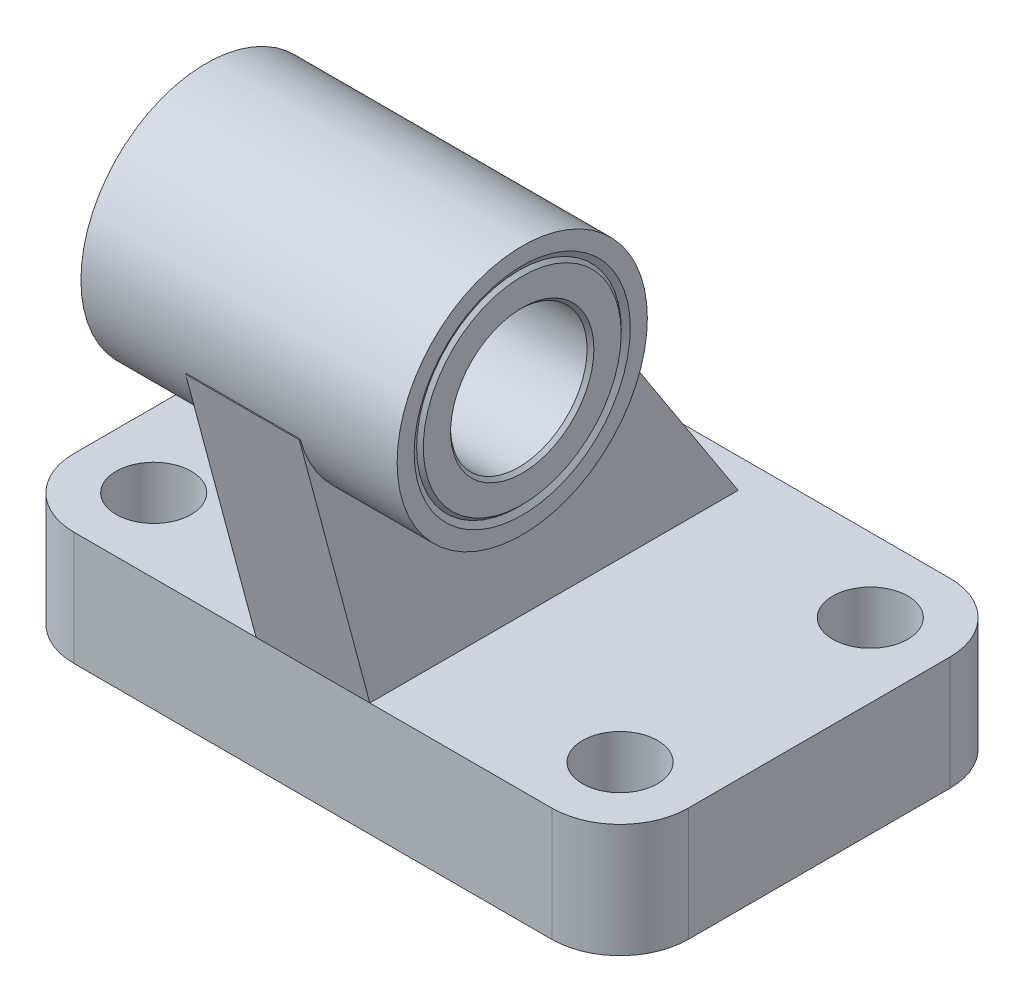
ISO-10303-21;
HEADER;
FILE_DESCRIPTION(('STEP AP214'),'2;1');
FILE_NAME('part.step','',(''),(''),'','','');
FILE_SCHEMA(('AUTOMOTIVE_DESIGN { 1 0 10303 214 1 1 1 1 }'));
ENDSEC;
DATA;
#1=APPLICATION_CONTEXT('core data for automotive mechanical design processes');
#2=APPLICATION_PROTOCOL_DEFINITION('international standard','automotive_design',2000,#1);
#3=PRODUCT_CONTEXT('',#1,'mechanical');
#4=PRODUCT('Part','Part','',(#3));
#5=PRODUCT_RELATED_PRODUCT_CATEGORY('part','',(#4));
#6=PRODUCT_DEFINITION_FORMATION('','',#4);
#7=PRODUCT_DEFINITION_CONTEXT('part definition',#1,'design');
#8=PRODUCT_DEFINITION('design','',#6,#7);
#9=PRODUCT_DEFINITION_SHAPE('','',#8);
#10=(LENGTH_UNIT() NAMED_UNIT(*) SI_UNIT(.MILLI.,.METRE.));
#11=(NAMED_UNIT(*) PLANE_ANGLE_UNIT() SI_UNIT($,.RADIAN.));
#12=(NAMED_UNIT(*) SI_UNIT($,.STERADIAN.) SOLID_ANGLE_UNIT());
#13=UNCERTAINTY_MEASURE_WITH_UNIT(LENGTH_MEASURE(1.E-05),#10,'distance_accuracy_value','');
#14=(GEOMETRIC_REPRESENTATION_CONTEXT(3) GLOBAL_UNCERTAINTY_ASSIGNED_CONTEXT((#13)) GLOBAL_UNIT_ASSIGNED_CONTEXT((#10,
#11,#12)) REPRESENTATION_CONTEXT('',''));
#15=CARTESIAN_POINT('',(0.,0.,0.));
#16=DIRECTION('',(0.,0.,1.));
#17=DIRECTION('',(1.,0.,0.));
#18=AXIS2_PLACEMENT_3D('',#15,#16,#17);
#19=CARTESIAN_POINT('',(13.9,36.,13.));
#20=DIRECTION('',(1.,0.,0.));
#21=DIRECTION('',(0.,0.,-1.));
#22=AXIS2_PLACEMENT_3D('',#19,#20,#21);
#23=CYLINDRICAL_SURFACE('',#22,9.);
#24=CARTESIAN_POINT('',(13.6,36.,13.));
#25=DIRECTION('',(1.,0.,0.));
#26=DIRECTION('',(0.,0.,-1.));
#27=AXIS2_PLACEMENT_3D('',#24,#25,#26);
#28=CIRCLE('',#27,9.);
#29=CARTESIAN_POINT('',(13.6,36.,4.));
#30=VERTEX_POINT('',#29);
#31=EDGE_CURVE('E554',#30,#30,#28,.T.);
#32=ORIENTED_EDGE('',*,*,#31,.F.);
#33=EDGE_LOOP('',(#32));
#34=FACE_BOUND('',#33,.T.);
#35=CARTESIAN_POINT('',(13.6113248654052,36.,13.));
#36=DIRECTION('',(1.,0.,0.));
#37=DIRECTION('',(0.,0.,-1.));
#38=AXIS2_PLACEMENT_3D('',#35,#36,#37);
#39=CIRCLE('',#38,9.);
#40=CARTESIAN_POINT('',(13.6113248654052,36.,4.));
#41=VERTEX_POINT('',#40);
#42=EDGE_CURVE('E311',#41,#41,#39,.T.);
#43=ORIENTED_EDGE('',*,*,#42,.T.);
#44=EDGE_LOOP('',(#43));
#45=FACE_BOUND('',#44,.T.);
#46=ADVANCED_FACE('F32',(#34,#45),#23,.F.);
#47=CARTESIAN_POINT('',(5.,38.5105795819209,3.63038944382608));
#48=DIRECTION('',(0.,-0.965925826289069,-0.25881904510252));
#49=DIRECTION('',(0.,0.25881904510252,-0.965925826289069));
#50=AXIS2_PLACEMENT_3D('',#47,#48,#49);
#51=PLANE('',#50);
#52=DIRECTION('',(-1.,0.,0.));
#53=VECTOR('',#52,1.);
#54=CARTESIAN_POINT('',(13.9,33.1529905038723,23.6251840891798));
#55=LINE('',#54,#53);
#56=CARTESIAN_POINT('',(-5.,33.1529905038723,23.6251840891798));
#57=VERTEX_POINT('',#56);
#58=CARTESIAN_POINT('',(5.,33.1529905038723,23.6251840891798));
#59=VERTEX_POINT('',#58);
#60=EDGE_CURVE('E140',#57,#59,#55,.F.);
#61=ORIENTED_EDGE('',*,*,#60,.F.);
#62=DIRECTION('',(0.,-0.25881904510252,0.965925826289069));
#63=VECTOR('',#62,1.);
#64=CARTESIAN_POINT('',(-5.,38.5105795819209,3.63038944382608));
#65=LINE('',#64,#63);
#66=CARTESIAN_POINT('',(-5.,33.1333302491977,23.698557158515));
#67=VERTEX_POINT('',#66);
#68=EDGE_CURVE('E128',#57,#67,#65,.T.);
#69=ORIENTED_EDGE('',*,*,#68,.T.);
#70=DIRECTION('',(-1.,0.,0.));
#71=VECTOR('',#70,1.);
#72=CARTESIAN_POINT('',(5.,33.1333302491977,23.698557158515));
#73=LINE('',#72,#71);
#74=CARTESIAN_POINT('',(5.,33.1333302491977,23.698557158515));
#75=VERTEX_POINT('',#74);
#76=EDGE_CURVE('E174',#75,#67,#73,.T.);
#77=ORIENTED_EDGE('',*,*,#76,.F.);
#78=DIRECTION('',(0.,-0.25881904510252,0.965925826289069));
#79=VECTOR('',#78,1.);
#80=CARTESIAN_POINT('',(5.,38.5105795819209,3.63038944382608));
#81=LINE('',#80,#79);
#82=EDGE_CURVE('E142',#59,#75,#81,.T.);
#83=ORIENTED_EDGE('',*,*,#82,.F.);
#84=EDGE_LOOP('',(#61,#69,#77,#83));
#85=FACE_BOUND('',#84,.T.);
#86=ADVANCED_FACE('F141',(#85),#51,.F.);
#87=CARTESIAN_POINT('',(5.,10.,-14.8845974231353));
#88=DIRECTION('',(0.,-0.544639035015028,0.838670567945423));
#89=DIRECTION('',(0.,-0.838670567945423,-0.544639035015028));
#90=AXIS2_PLACEMENT_3D('',#87,#88,#89);
#91=PLANE('',#90);
#92=DIRECTION('',(-1.,0.,0.));
#93=VECTOR('',#92,1.);
#94=CARTESIAN_POINT('',(13.9,36.,2.));
#95=LINE('',#94,#93);
#96=CARTESIAN_POINT('',(5.,36.,2.));
#97=VERTEX_POINT('',#96);
#98=CARTESIAN_POINT('',(-5.,36.,2.));
#99=VERTEX_POINT('',#98);
#100=EDGE_CURVE('E47',#97,#99,#95,.T.);
#101=ORIENTED_EDGE('',*,*,#100,.F.);
#102=DIRECTION('',(0.,0.838670567945423,0.544639035015028));
#103=VECTOR('',#102,1.);
#104=CARTESIAN_POINT('',(5.,10.,-14.8845974231353));
#105=LINE('',#104,#103);
#106=CARTESIAN_POINT('',(5.,10.,-14.8845974231353));
#107=VERTEX_POINT('',#106);
#108=EDGE_CURVE('E167',#107,#97,#105,.T.);
#109=ORIENTED_EDGE('',*,*,#108,.F.);
#110=DIRECTION('',(-1.,0.,0.));
#111=VECTOR('',#110,1.);
#112=CARTESIAN_POINT('',(5.,10.,-14.8845974231353));
#113=LINE('',#112,#111);
#114=CARTESIAN_POINT('',(-5.,10.,-14.8845974231353));
#115=VERTEX_POINT('',#114);
#116=EDGE_CURVE('E169',#107,#115,#113,.T.);
#117=ORIENTED_EDGE('',*,*,#116,.T.);
#118=DIRECTION('',(0.,0.838670567945423,0.544639035015028));
#119=VECTOR('',#118,1.);
#120=CARTESIAN_POINT('',(-5.,10.,-14.8845974231353));
#121=LINE('',#120,#119);
#122=EDGE_CURVE('E158',#115,#99,#121,.T.);
#123=ORIENTED_EDGE('',*,*,#122,.T.);
#124=EDGE_LOOP('',(#101,#109,#117,#123));
#125=FACE_BOUND('',#124,.T.);
#126=ADVANCED_FACE('F285',(#125),#91,.F.);
#127=CARTESIAN_POINT('',(-21.,10.,11.5));
#128=DIRECTION('',(0.,1.,0.));
#129=DIRECTION('',(0.,0.,1.));
#130=AXIS2_PLACEMENT_3D('',#127,#128,#129);
#131=PLANE('',#130);
#132=CARTESIAN_POINT('',(20.5,10.,-11.));
#133=DIRECTION('',(0.,1.,0.));
#134=DIRECTION('',(0.,0.,1.));
#135=AXIS2_PLACEMENT_3D('',#132,#133,#134);
#136=CIRCLE('',#135,3.3);
#137=CARTESIAN_POINT('',(20.5,10.,-7.7));
#138=VERTEX_POINT('',#137);
#139=EDGE_CURVE('E314',#138,#138,#136,.T.);
#140=ORIENTED_EDGE('',*,*,#139,.F.);
#141=EDGE_LOOP('',(#140));
#142=FACE_BOUND('',#141,.T.);
#143=CARTESIAN_POINT('',(-20.5,10.,-11.));
#144=DIRECTION('',(0.,1.,0.));
#145=DIRECTION('',(0.,0.,1.));
#146=AXIS2_PLACEMENT_3D('',#143,#144,#145);
#147=CIRCLE('',#146,3.3);
#148=CARTESIAN_POINT('',(-20.5,10.,-7.7));
#149=VERTEX_POINT('',#148);
#150=EDGE_CURVE('E326',#149,#149,#147,.T.);
#151=ORIENTED_EDGE('',*,*,#150,.F.);
#152=EDGE_LOOP('',(#151));
#153=FACE_BOUND('',#152,.T.);
#154=CARTESIAN_POINT('',(20.5,10.,11.));
#155=DIRECTION('',(0.,1.,0.));
#156=DIRECTION('',(0.,0.,1.));
#157=AXIS2_PLACEMENT_3D('',#154,#155,#156);
#158=CIRCLE('',#157,3.3);
#159=CARTESIAN_POINT('',(20.5,10.,14.3));
#160=VERTEX_POINT('',#159);
#161=EDGE_CURVE('E332',#160,#160,#158,.T.);
#162=ORIENTED_EDGE('',*,*,#161,.F.);
#163=EDGE_LOOP('',(#162));
#164=FACE_BOUND('',#163,.T.);
#165=CARTESIAN_POINT('',(-20.5,10.,11.));
#166=DIRECTION('',(0.,1.,0.));
#167=DIRECTION('',(0.,0.,1.));
#168=AXIS2_PLACEMENT_3D('',#165,#166,#167);
#169=CIRCLE('',#168,3.3);
#170=CARTESIAN_POINT('',(-20.5,10.,14.3));
#171=VERTEX_POINT('',#170);
#172=EDGE_CURVE('E338',#171,#171,#169,.T.);
#173=ORIENTED_EDGE('',*,*,#172,.F.);
#174=EDGE_LOOP('',(#173));
#175=FACE_BOUND('',#174,.T.);
#176=DIRECTION('',(1.,0.,0.));
#177=VECTOR('',#176,1.);
#178=CARTESIAN_POINT('',(-21.,10.,17.5));
#179=LINE('',#178,#177);
#180=CARTESIAN_POINT('',(-21.,10.,17.5));
#181=VERTEX_POINT('',#180);
#182=CARTESIAN_POINT('',(-5.00000000000001,10.,17.5));
#183=VERTEX_POINT('',#182);
#184=EDGE_CURVE('E182',#181,#183,#179,.T.);
#185=ORIENTED_EDGE('',*,*,#184,.T.);
#186=DIRECTION('',(0.,0.,-1.));
#187=VECTOR('',#186,1.);
#188=CARTESIAN_POINT('',(-5.,10.,17.5));
#189=LINE('',#188,#187);
#190=EDGE_CURVE('E156',#183,#115,#189,.T.);
#191=ORIENTED_EDGE('',*,*,#190,.T.);
#192=ORIENTED_EDGE('',*,*,#116,.F.);
#193=DIRECTION('',(0.,0.,-1.));
#194=VECTOR('',#193,1.);
#195=CARTESIAN_POINT('',(5.,10.,17.5));
#196=LINE('',#195,#194);
#197=CARTESIAN_POINT('',(4.99999999999999,10.,17.5));
#198=VERTEX_POINT('',#197);
#199=EDGE_CURVE('E164',#198,#107,#196,.T.);
#200=ORIENTED_EDGE('',*,*,#199,.F.);
#201=CARTESIAN_POINT('',(21.,10.,17.5));
#202=VERTEX_POINT('',#201);
#203=EDGE_CURVE('E180',#198,#202,#179,.T.);
#204=ORIENTED_EDGE('',*,*,#203,.T.);
#205=CARTESIAN_POINT('',(21.,10.,11.5));
#206=DIRECTION('',(0.,1.,0.));
#207=DIRECTION('',(0.,0.,1.));
#208=AXIS2_PLACEMENT_3D('',#205,#206,#207);
#209=CIRCLE('',#208,5.99999999999995);
#210=CARTESIAN_POINT('',(27.,10.,11.5));
#211=VERTEX_POINT('',#210);
#212=EDGE_CURVE('E185',#202,#211,#209,.T.);
#213=ORIENTED_EDGE('',*,*,#212,.T.);
#214=DIRECTION('',(0.,0.,-1.));
#215=VECTOR('',#214,1.);
#216=CARTESIAN_POINT('',(27.,10.,11.5));
#217=LINE('',#216,#215);
#218=CARTESIAN_POINT('',(27.,10.,-11.5));
#219=VERTEX_POINT('',#218);
#220=EDGE_CURVE('E187',#211,#219,#217,.T.);
#221=ORIENTED_EDGE('',*,*,#220,.T.);
#222=CARTESIAN_POINT('',(21.,10.,-11.5));
#223=DIRECTION('',(0.,1.,0.));
#224=DIRECTION('',(0.,0.,1.));
#225=AXIS2_PLACEMENT_3D('',#222,#223,#224);
#226=CIRCLE('',#225,5.99999999999995);
#227=CARTESIAN_POINT('',(21.,10.,-17.5));
#228=VERTEX_POINT('',#227);
#229=EDGE_CURVE('E189',#219,#228,#226,.T.);
#230=ORIENTED_EDGE('',*,*,#229,.T.);
#231=DIRECTION('',(-1.,0.,0.));
#232=VECTOR('',#231,1.);
#233=CARTESIAN_POINT('',(21.,10.,-17.5));
#234=LINE('',#233,#232);
#235=CARTESIAN_POINT('',(-21.,10.,-17.5));
#236=VERTEX_POINT('',#235);
#237=EDGE_CURVE('E191',#228,#236,#234,.T.);
#238=ORIENTED_EDGE('',*,*,#237,.T.);
#239=CARTESIAN_POINT('',(-21.,10.,-11.5));
#240=DIRECTION('',(0.,1.,0.));
#241=DIRECTION('',(0.,0.,1.));
#242=AXIS2_PLACEMENT_3D('',#239,#240,#241);
#243=CIRCLE('',#242,5.99999999999995);
#244=CARTESIAN_POINT('',(-27.,10.,-11.5));
#245=VERTEX_POINT('',#244);
#246=EDGE_CURVE('E193',#236,#245,#243,.T.);
#247=ORIENTED_EDGE('',*,*,#246,.T.);
#248=DIRECTION('',(0.,0.,1.));
#249=VECTOR('',#248,1.);
#250=CARTESIAN_POINT('',(-27.,10.,-11.5));
#251=LINE('',#250,#249);
#252=CARTESIAN_POINT('',(-27.,10.,11.5));
#253=VERTEX_POINT('',#252);
#254=EDGE_CURVE('E195',#245,#253,#251,.T.);
#255=ORIENTED_EDGE('',*,*,#254,.T.);
#256=CARTESIAN_POINT('',(-21.,10.,11.5));
#257=DIRECTION('',(0.,1.,0.));
#258=DIRECTION('',(0.,0.,1.));
#259=AXIS2_PLACEMENT_3D('',#256,#257,#258);
#260=CIRCLE('',#259,5.99999999999995);
#261=EDGE_CURVE('E177',#253,#181,#260,.T.);
#262=ORIENTED_EDGE('',*,*,#261,.T.);
#263=EDGE_LOOP('',(#185,#191,#192,#200,#204,#213,#221,#230,#238,#247,#255,#262));
#264=FACE_BOUND('',#263,.T.);
#265=ADVANCED_FACE('F258',(#142,#153,#164,#175,#264),#131,.T.);
#266=CARTESIAN_POINT('',(-21.,10.,11.5));
#267=DIRECTION('',(0.,-1.,0.));
#268=DIRECTION('',(0.,0.,-1.));
#269=AXIS2_PLACEMENT_3D('',#266,#267,#268);
#270=CYLINDRICAL_SURFACE('',#269,5.99999999999995);
#271=CARTESIAN_POINT('',(-21.,0.,11.5));
#272=DIRECTION('',(0.,1.,0.));
#273=DIRECTION('',(0.,0.,1.));
#274=AXIS2_PLACEMENT_3D('',#271,#272,#273);
#275=CIRCLE('',#274,5.99999999999995);
#276=CARTESIAN_POINT('',(-27.,0.,11.5));
#277=VERTEX_POINT('',#276);
#278=CARTESIAN_POINT('',(-21.,0.,17.5));
#279=VERTEX_POINT('',#278);
#280=EDGE_CURVE('E176',#277,#279,#275,.T.);
#281=ORIENTED_EDGE('',*,*,#280,.T.);
#282=DIRECTION('',(0.,-1.,0.));
#283=VECTOR('',#282,1.);
#284=CARTESIAN_POINT('',(-21.,10.,17.5));
#285=LINE('',#284,#283);
#286=EDGE_CURVE('E40',#181,#279,#285,.T.);
#287=ORIENTED_EDGE('',*,*,#286,.F.);
#288=ORIENTED_EDGE('',*,*,#261,.F.);
#289=DIRECTION('',(0.,-1.,0.));
#290=VECTOR('',#289,1.);
#291=CARTESIAN_POINT('',(-27.,10.,11.5));
#292=LINE('',#291,#290);
#293=EDGE_CURVE('E197',#253,#277,#292,.T.);
#294=ORIENTED_EDGE('',*,*,#293,.T.);
#295=EDGE_LOOP('',(#281,#287,#288,#294));
#296=FACE_BOUND('',#295,.T.);
#297=ADVANCED_FACE('F34',(#296),#270,.T.);
#298=CARTESIAN_POINT('',(-21.,10.,17.5));
#299=DIRECTION('',(0.,0.,-1.));
#300=DIRECTION('',(-1.,0.,0.));
#301=AXIS2_PLACEMENT_3D('',#298,#299,#300);
#302=PLANE('',#301);
#303=DIRECTION('',(1.,0.,0.));
#304=VECTOR('',#303,1.);
#305=CARTESIAN_POINT('',(-21.,0.,17.5));
#306=LINE('',#305,#304);
#307=CARTESIAN_POINT('',(21.,0.,17.5));
#308=VERTEX_POINT('',#307);
#309=EDGE_CURVE('E200',#279,#308,#306,.T.);
#310=ORIENTED_EDGE('',*,*,#309,.T.);
#311=DIRECTION('',(0.,-1.,0.));
#312=VECTOR('',#311,1.);
#313=CARTESIAN_POINT('',(21.,10.,17.5));
#314=LINE('',#313,#312);
#315=EDGE_CURVE('E230',#202,#308,#314,.T.);
#316=ORIENTED_EDGE('',*,*,#315,.F.);
#317=ORIENTED_EDGE('',*,*,#203,.F.);
#318=DIRECTION('',(-1.,0.,0.));
#319=VECTOR('',#318,1.);
#320=CARTESIAN_POINT('',(5.,10.,17.5));
#321=LINE('',#320,#319);
#322=EDGE_CURVE('E172',#198,#183,#321,.T.);
#323=ORIENTED_EDGE('',*,*,#322,.T.);
#324=ORIENTED_EDGE('',*,*,#184,.F.);
#325=ORIENTED_EDGE('',*,*,#286,.T.);
#326=EDGE_LOOP('',(#310,#316,#317,#323,#324,#325));
#327=FACE_BOUND('',#326,.T.);
#328=ADVANCED_FACE('F235',(#327),#302,.F.);
#329=CARTESIAN_POINT('',(21.,10.,11.5));
#330=DIRECTION('',(0.,-1.,0.));
#331=DIRECTION('',(0.,0.,-1.));
#332=AXIS2_PLACEMENT_3D('',#329,#330,#331);
#333=CYLINDRICAL_SURFACE('',#332,5.99999999999995);
#334=CARTESIAN_POINT('',(21.,0.,11.5));
#335=DIRECTION('',(0.,1.,0.));
#336=DIRECTION('',(0.,0.,1.));
#337=AXIS2_PLACEMENT_3D('',#334,#335,#336);
#338=CIRCLE('',#337,5.99999999999995);
#339=CARTESIAN_POINT('',(27.,0.,11.5));
#340=VERTEX_POINT('',#339);
#341=EDGE_CURVE('E202',#308,#340,#338,.T.);
#342=ORIENTED_EDGE('',*,*,#341,.T.);
#343=DIRECTION('',(0.,-1.,0.));
#344=VECTOR('',#343,1.);
#345=CARTESIAN_POINT('',(27.,10.,11.5));
#346=LINE('',#345,#344);
#347=EDGE_CURVE('E227',#211,#340,#346,.T.);
#348=ORIENTED_EDGE('',*,*,#347,.F.);
#349=ORIENTED_EDGE('',*,*,#212,.F.);
#350=ORIENTED_EDGE('',*,*,#315,.T.);
#351=EDGE_LOOP('',(#342,#348,#349,#350));
#352=FACE_BOUND('',#351,.T.);
#353=ADVANCED_FACE('F250',(#352),#333,.T.);
#354=CARTESIAN_POINT('',(27.,10.,11.5));
#355=DIRECTION('',(-1.,0.,0.));
#356=DIRECTION('',(0.,0.,1.));
#357=AXIS2_PLACEMENT_3D('',#354,#355,#356);
#358=PLANE('',#357);
#359=DIRECTION('',(0.,0.,-1.));
#360=VECTOR('',#359,1.);
#361=CARTESIAN_POINT('',(27.,0.,11.5));
#362=LINE('',#361,#360);
#363=CARTESIAN_POINT('',(27.,0.,-11.5));
#364=VERTEX_POINT('',#363);
#365=EDGE_CURVE('E204',#340,#364,#362,.T.);
#366=ORIENTED_EDGE('',*,*,#365,.T.);
#367=DIRECTION('',(0.,-1.,0.));
#368=VECTOR('',#367,1.);
#369=CARTESIAN_POINT('',(27.,10.,-11.5));
#370=LINE('',#369,#368);
#371=EDGE_CURVE('E224',#219,#364,#370,.T.);
#372=ORIENTED_EDGE('',*,*,#371,.F.);
#373=ORIENTED_EDGE('',*,*,#220,.F.);
#374=ORIENTED_EDGE('',*,*,#347,.T.);
#375=EDGE_LOOP('',(#366,#372,#373,#374));
#376=FACE_BOUND('',#375,.T.);
#377=ADVANCED_FACE('F254',(#376),#358,.F.);
#378=CARTESIAN_POINT('',(21.,10.,-11.5));
#379=DIRECTION('',(0.,-1.,0.));
#380=DIRECTION('',(0.,0.,-1.));
#381=AXIS2_PLACEMENT_3D('',#378,#379,#380);
#382=CYLINDRICAL_SURFACE('',#381,5.99999999999995);
#383=CARTESIAN_POINT('',(21.,0.,-11.5));
#384=DIRECTION('',(0.,1.,0.));
#385=DIRECTION('',(0.,0.,1.));
#386=AXIS2_PLACEMENT_3D('',#383,#384,#385);
#387=CIRCLE('',#386,5.99999999999995);
#388=CARTESIAN_POINT('',(21.,0.,-17.5));
#389=VERTEX_POINT('',#388);
#390=EDGE_CURVE('E206',#364,#389,#387,.T.);
#391=ORIENTED_EDGE('',*,*,#390,.T.);
#392=DIRECTION('',(0.,-1.,0.));
#393=VECTOR('',#392,1.);
#394=CARTESIAN_POINT('',(21.,10.,-17.5));
#395=LINE('',#394,#393);
#396=EDGE_CURVE('E221',#228,#389,#395,.T.);
#397=ORIENTED_EDGE('',*,*,#396,.F.);
#398=ORIENTED_EDGE('',*,*,#229,.F.);
#399=ORIENTED_EDGE('',*,*,#371,.T.);
#400=EDGE_LOOP('',(#391,#397,#398,#399));
#401=FACE_BOUND('',#400,.T.);
#402=ADVANCED_FACE('F389',(#401),#382,.T.);
#403=CARTESIAN_POINT('',(21.,10.,-17.5));
#404=DIRECTION('',(0.,0.,1.));
#405=DIRECTION('',(1.,0.,0.));
#406=AXIS2_PLACEMENT_3D('',#403,#404,#405);
#407=PLANE('',#406);
#408=DIRECTION('',(-1.,0.,0.));
#409=VECTOR('',#408,1.);
#410=CARTESIAN_POINT('',(21.,0.,-17.5));
#411=LINE('',#410,#409);
#412=CARTESIAN_POINT('',(-21.,0.,-17.5));
#413=VERTEX_POINT('',#412);
#414=EDGE_CURVE('E208',#389,#413,#411,.T.);
#415=ORIENTED_EDGE('',*,*,#414,.T.);
#416=DIRECTION('',(0.,-1.,0.));
#417=VECTOR('',#416,1.);
#418=CARTESIAN_POINT('',(-21.,10.,-17.5));
#419=LINE('',#418,#417);
#420=EDGE_CURVE('E218',#236,#413,#419,.T.);
#421=ORIENTED_EDGE('',*,*,#420,.F.);
#422=ORIENTED_EDGE('',*,*,#237,.F.);
#423=ORIENTED_EDGE('',*,*,#396,.T.);
#424=EDGE_LOOP('',(#415,#421,#422,#423));
#425=FACE_BOUND('',#424,.T.);
#426=ADVANCED_FACE('F385',(#425),#407,.F.);
#427=CARTESIAN_POINT('',(-21.,10.,-11.5));
#428=DIRECTION('',(0.,-1.,0.));
#429=DIRECTION('',(0.,0.,-1.));
#430=AXIS2_PLACEMENT_3D('',#427,#428,#429);
#431=CYLINDRICAL_SURFACE('',#430,5.99999999999995);
#432=CARTESIAN_POINT('',(-21.,0.,-11.5));
#433=DIRECTION('',(0.,1.,0.));
#434=DIRECTION('',(0.,0.,1.));
#435=AXIS2_PLACEMENT_3D('',#432,#433,#434);
#436=CIRCLE('',#435,5.99999999999995);
#437=CARTESIAN_POINT('',(-27.,0.,-11.5));
#438=VERTEX_POINT('',#437);
#439=EDGE_CURVE('E210',#413,#438,#436,.T.);
#440=ORIENTED_EDGE('',*,*,#439,.T.);
#441=DIRECTION('',(0.,-1.,0.));
#442=VECTOR('',#441,1.);
#443=CARTESIAN_POINT('',(-27.,10.,-11.5));
#444=LINE('',#443,#442);
#445=EDGE_CURVE('E215',#245,#438,#444,.T.);
#446=ORIENTED_EDGE('',*,*,#445,.F.);
#447=ORIENTED_EDGE('',*,*,#246,.F.);
#448=ORIENTED_EDGE('',*,*,#420,.T.);
#449=EDGE_LOOP('',(#440,#446,#447,#448));
#450=FACE_BOUND('',#449,.T.);
#451=ADVANCED_FACE('F381',(#450),#431,.T.);
#452=CARTESIAN_POINT('',(-27.,10.,-11.5));
#453=DIRECTION('',(1.,0.,0.));
#454=DIRECTION('',(0.,0.,-1.));
#455=AXIS2_PLACEMENT_3D('',#452,#453,#454);
#456=PLANE('',#455);
#457=DIRECTION('',(0.,0.,1.));
#458=VECTOR('',#457,1.);
#459=CARTESIAN_POINT('',(-27.,0.,-11.5));
#460=LINE('',#459,#458);
#461=EDGE_CURVE('E181',#438,#277,#460,.T.);
#462=ORIENTED_EDGE('',*,*,#461,.T.);
#463=ORIENTED_EDGE('',*,*,#293,.F.);
#464=ORIENTED_EDGE('',*,*,#254,.F.);
#465=ORIENTED_EDGE('',*,*,#445,.T.);
#466=EDGE_LOOP('',(#462,#463,#464,#465));
#467=FACE_BOUND('',#466,.T.);
#468=ADVANCED_FACE('F273',(#467),#456,.F.);
#469=CARTESIAN_POINT('',(-21.,0.,11.5));
#470=DIRECTION('',(0.,1.,0.));
#471=DIRECTION('',(0.,0.,1.));
#472=AXIS2_PLACEMENT_3D('',#469,#470,#471);
#473=PLANE('',#472);
#474=CARTESIAN_POINT('',(20.5,0.,-11.));
#475=DIRECTION('',(0.,1.,0.));
#476=DIRECTION('',(0.,0.,1.));
#477=AXIS2_PLACEMENT_3D('',#474,#475,#476);
#478=CIRCLE('',#477,3.3);
#479=CARTESIAN_POINT('',(20.5,0.,-7.7));
#480=VERTEX_POINT('',#479);
#481=EDGE_CURVE('E323',#480,#480,#478,.T.);
#482=ORIENTED_EDGE('',*,*,#481,.T.);
#483=EDGE_LOOP('',(#482));
#484=FACE_BOUND('',#483,.T.);
#485=CARTESIAN_POINT('',(-20.5,0.,-11.));
#486=DIRECTION('',(0.,1.,0.));
#487=DIRECTION('',(0.,0.,1.));
#488=AXIS2_PLACEMENT_3D('',#485,#486,#487);
#489=CIRCLE('',#488,3.3);
#490=CARTESIAN_POINT('',(-20.5,0.,-7.7));
#491=VERTEX_POINT('',#490);
#492=EDGE_CURVE('E329',#491,#491,#489,.T.);
#493=ORIENTED_EDGE('',*,*,#492,.T.);
#494=EDGE_LOOP('',(#493));
#495=FACE_BOUND('',#494,.T.);
#496=CARTESIAN_POINT('',(20.5,0.,11.));
#497=DIRECTION('',(0.,1.,0.));
#498=DIRECTION('',(0.,0.,1.));
#499=AXIS2_PLACEMENT_3D('',#496,#497,#498);
#500=CIRCLE('',#499,3.3);
#501=CARTESIAN_POINT('',(20.5,0.,14.3));
#502=VERTEX_POINT('',#501);
#503=EDGE_CURVE('E335',#502,#502,#500,.T.);
#504=ORIENTED_EDGE('',*,*,#503,.T.);
#505=EDGE_LOOP('',(#504));
#506=FACE_BOUND('',#505,.T.);
#507=CARTESIAN_POINT('',(-20.5,0.,11.));
#508=DIRECTION('',(0.,1.,0.));
#509=DIRECTION('',(0.,0.,1.));
#510=AXIS2_PLACEMENT_3D('',#507,#508,#509);
#511=CIRCLE('',#510,3.3);
#512=CARTESIAN_POINT('',(-20.5,0.,14.3));
#513=VERTEX_POINT('',#512);
#514=EDGE_CURVE('E341',#513,#513,#511,.T.);
#515=ORIENTED_EDGE('',*,*,#514,.T.);
#516=EDGE_LOOP('',(#515));
#517=FACE_BOUND('',#516,.T.);
#518=ORIENTED_EDGE('',*,*,#280,.F.);
#519=ORIENTED_EDGE('',*,*,#461,.F.);
#520=ORIENTED_EDGE('',*,*,#439,.F.);
#521=ORIENTED_EDGE('',*,*,#414,.F.);
#522=ORIENTED_EDGE('',*,*,#390,.F.);
#523=ORIENTED_EDGE('',*,*,#365,.F.);
#524=ORIENTED_EDGE('',*,*,#341,.F.);
#525=ORIENTED_EDGE('',*,*,#309,.F.);
#526=EDGE_LOOP('',(#518,#519,#520,#521,#522,#523,#524,#525));
#527=FACE_BOUND('',#526,.T.);
#528=ADVANCED_FACE('F243',(#484,#495,#506,#517,#527),#473,.F.);
#529=CARTESIAN_POINT('',(5.,33.1333302491977,23.698557158515));
#530=DIRECTION('',(0.,0.258819045102521,-0.965925826289068));
#531=DIRECTION('',(0.,0.965925826289068,0.258819045102521));
#532=AXIS2_PLACEMENT_3D('',#529,#530,#531);
#533=PLANE('',#532);
#534=ORIENTED_EDGE('',*,*,#76,.T.);
#535=DIRECTION('',(0.,-0.965925826289068,-0.258819045102521));
#536=VECTOR('',#535,1.);
#537=CARTESIAN_POINT('',(-5.,33.1333302491977,23.698557158515));
#538=LINE('',#537,#536);
#539=EDGE_CURVE('E134',#67,#183,#538,.T.);
#540=ORIENTED_EDGE('',*,*,#539,.T.);
#541=ORIENTED_EDGE('',*,*,#322,.F.);
#542=DIRECTION('',(0.,-0.965925826289068,-0.258819045102521));
#543=VECTOR('',#542,1.);
#544=CARTESIAN_POINT('',(5.,33.1333302491977,23.698557158515));
#545=LINE('',#544,#543);
#546=EDGE_CURVE('E161',#75,#198,#545,.T.);
#547=ORIENTED_EDGE('',*,*,#546,.F.);
#548=EDGE_LOOP('',(#534,#540,#541,#547));
#549=FACE_BOUND('',#548,.T.);
#550=ADVANCED_FACE('F265',(#549),#533,.F.);
#551=CARTESIAN_POINT('',(5.,0.,0.));
#552=DIRECTION('',(1.,0.,0.));
#553=DIRECTION('',(0.,0.,-1.));
#554=AXIS2_PLACEMENT_3D('',#551,#552,#553);
#555=PLANE('',#554);
#556=ORIENTED_EDGE('',*,*,#108,.T.);
#557=CARTESIAN_POINT('',(5.,36.,13.));
#558=DIRECTION('',(1.,0.,0.));
#559=DIRECTION('',(0.,0.,-1.));
#560=AXIS2_PLACEMENT_3D('',#557,#558,#559);
#561=CIRCLE('',#560,11.);
#562=EDGE_CURVE('E54',#97,#59,#561,.F.);
#563=ORIENTED_EDGE('',*,*,#562,.T.);
#564=ORIENTED_EDGE('',*,*,#82,.T.);
#565=ORIENTED_EDGE('',*,*,#546,.T.);
#566=ORIENTED_EDGE('',*,*,#199,.T.);
#567=EDGE_LOOP('',(#556,#563,#564,#565,#566));
#568=FACE_BOUND('',#567,.T.);
#569=ADVANCED_FACE('F263',(#568),#555,.T.);
#570=CARTESIAN_POINT('',(-5.,0.,0.));
#571=DIRECTION('',(1.,0.,0.));
#572=DIRECTION('',(0.,0.,-1.));
#573=AXIS2_PLACEMENT_3D('',#570,#571,#572);
#574=PLANE('',#573);
#575=CARTESIAN_POINT('',(-5.,36.,13.));
#576=DIRECTION('',(1.,0.,0.));
#577=DIRECTION('',(0.,0.,-1.));
#578=AXIS2_PLACEMENT_3D('',#575,#576,#577);
#579=CIRCLE('',#578,11.);
#580=EDGE_CURVE('E11',#99,#57,#579,.F.);
#581=ORIENTED_EDGE('',*,*,#580,.F.);
#582=ORIENTED_EDGE('',*,*,#122,.F.);
#583=ORIENTED_EDGE('',*,*,#190,.F.);
#584=ORIENTED_EDGE('',*,*,#539,.F.);
#585=ORIENTED_EDGE('',*,*,#68,.F.);
#586=EDGE_LOOP('',(#581,#582,#583,#584,#585));
#587=FACE_BOUND('',#586,.T.);
#588=ADVANCED_FACE('F130',(#587),#574,.F.);
#589=CARTESIAN_POINT('',(13.9,36.,13.));
#590=DIRECTION('',(-1.,0.,0.));
#591=DIRECTION('',(0.,0.,1.));
#592=AXIS2_PLACEMENT_3D('',#589,#590,#591);
#593=CYLINDRICAL_SURFACE('',#592,11.);
#594=ORIENTED_EDGE('',*,*,#562,.F.);
#595=ORIENTED_EDGE('',*,*,#100,.T.);
#596=ORIENTED_EDGE('',*,*,#580,.T.);
#597=ORIENTED_EDGE('',*,*,#60,.T.);
#598=EDGE_LOOP('',(#594,#595,#596,#597));
#599=FACE_BOUND('',#598,.T.);
#600=CARTESIAN_POINT('',(13.9,36.,13.));
#601=DIRECTION('',(1.,0.,0.));
#602=DIRECTION('',(0.,0.,-1.));
#603=AXIS2_PLACEMENT_3D('',#600,#601,#602);
#604=CIRCLE('',#603,11.);
#605=CARTESIAN_POINT('',(13.9,36.,2.));
#606=VERTEX_POINT('',#605);
#607=EDGE_CURVE('E147',#606,#606,#604,.T.);
#608=ORIENTED_EDGE('',*,*,#607,.F.);
#609=EDGE_LOOP('',(#608));
#610=FACE_BOUND('',#609,.T.);
#611=CARTESIAN_POINT('',(-13.9,36.,13.));
#612=DIRECTION('',(1.,0.,0.));
#613=DIRECTION('',(0.,0.,-1.));
#614=AXIS2_PLACEMENT_3D('',#611,#612,#613);
#615=CIRCLE('',#614,11.);
#616=CARTESIAN_POINT('',(-13.9,36.,2.));
#617=VERTEX_POINT('',#616);
#618=EDGE_CURVE('E150',#617,#617,#615,.T.);
#619=ORIENTED_EDGE('',*,*,#618,.T.);
#620=EDGE_LOOP('',(#619));
#621=FACE_BOUND('',#620,.T.);
#622=ADVANCED_FACE('F145',(#599,#610,#621),#593,.T.);
#623=CARTESIAN_POINT('',(13.9,36.,13.));
#624=DIRECTION('',(1.,0.,0.));
#625=DIRECTION('',(0.,0.,-1.));
#626=AXIS2_PLACEMENT_3D('',#623,#624,#625);
#627=PLANE('',#626);
#628=CARTESIAN_POINT('',(13.9,36.,13.));
#629=DIRECTION('',(1.,0.,0.));
#630=DIRECTION('',(0.,0.,-1.));
#631=AXIS2_PLACEMENT_3D('',#628,#629,#630);
#632=CIRCLE('',#631,9.5);
#633=CARTESIAN_POINT('',(13.9,36.,3.5));
#634=VERTEX_POINT('',#633);
#635=EDGE_CURVE('E317',#634,#634,#632,.T.);
#636=ORIENTED_EDGE('',*,*,#635,.F.);
#637=EDGE_LOOP('',(#636));
#638=FACE_BOUND('',#637,.T.);
#639=ORIENTED_EDGE('',*,*,#607,.T.);
#640=EDGE_LOOP('',(#639));
#641=FACE_BOUND('',#640,.T.);
#642=ADVANCED_FACE('F350',(#638,#641),#627,.T.);
#643=CARTESIAN_POINT('',(-13.9,36.,13.));
#644=DIRECTION('',(1.,0.,0.));
#645=DIRECTION('',(0.,0.,-1.));
#646=AXIS2_PLACEMENT_3D('',#643,#644,#645);
#647=PLANE('',#646);
#648=CARTESIAN_POINT('',(-13.9,36.,13.));
#649=DIRECTION('',(1.,0.,0.));
#650=DIRECTION('',(0.,0.,-1.));
#651=AXIS2_PLACEMENT_3D('',#648,#649,#650);
#652=CIRCLE('',#651,9.5);
#653=CARTESIAN_POINT('',(-13.9,36.,3.5));
#654=VERTEX_POINT('',#653);
#655=EDGE_CURVE('E310',#654,#654,#652,.T.);
#656=ORIENTED_EDGE('',*,*,#655,.T.);
#657=EDGE_LOOP('',(#656));
#658=FACE_BOUND('',#657,.T.);
#659=ORIENTED_EDGE('',*,*,#618,.F.);
#660=EDGE_LOOP('',(#659));
#661=FACE_BOUND('',#660,.T.);
#662=ADVANCED_FACE('F347',(#658,#661),#647,.F.);
#663=CARTESIAN_POINT('',(-20.5,10.,11.));
#664=DIRECTION('',(0.,1.,0.));
#665=DIRECTION('',(0.,0.,1.));
#666=AXIS2_PLACEMENT_3D('',#663,#664,#665);
#667=CYLINDRICAL_SURFACE('',#666,3.3);
#668=ORIENTED_EDGE('',*,*,#514,.F.);
#669=EDGE_LOOP('',(#668));
#670=FACE_BOUND('',#669,.T.);
#671=ORIENTED_EDGE('',*,*,#172,.T.);
#672=EDGE_LOOP('',(#671));
#673=FACE_BOUND('',#672,.T.);
#674=ADVANCED_FACE('F349',(#670,#673),#667,.F.);
#675=CARTESIAN_POINT('',(20.5,10.,11.));
#676=DIRECTION('',(0.,1.,0.));
#677=DIRECTION('',(0.,0.,1.));
#678=AXIS2_PLACEMENT_3D('',#675,#676,#677);
#679=CYLINDRICAL_SURFACE('',#678,3.3);
#680=ORIENTED_EDGE('',*,*,#503,.F.);
#681=EDGE_LOOP('',(#680));
#682=FACE_BOUND('',#681,.T.);
#683=ORIENTED_EDGE('',*,*,#161,.T.);
#684=EDGE_LOOP('',(#683));
#685=FACE_BOUND('',#684,.T.);
#686=ADVANCED_FACE('F357',(#682,#685),#679,.F.);
#687=CARTESIAN_POINT('',(-20.5,10.,-11.));
#688=DIRECTION('',(0.,1.,0.));
#689=DIRECTION('',(0.,0.,1.));
#690=AXIS2_PLACEMENT_3D('',#687,#688,#689);
#691=CYLINDRICAL_SURFACE('',#690,3.3);
#692=ORIENTED_EDGE('',*,*,#492,.F.);
#693=EDGE_LOOP('',(#692));
#694=FACE_BOUND('',#693,.T.);
#695=ORIENTED_EDGE('',*,*,#150,.T.);
#696=EDGE_LOOP('',(#695));
#697=FACE_BOUND('',#696,.T.);
#698=ADVANCED_FACE('F442',(#694,#697),#691,.F.);
#699=CARTESIAN_POINT('',(20.5,10.,-11.));
#700=DIRECTION('',(0.,1.,0.));
#701=DIRECTION('',(0.,0.,1.));
#702=AXIS2_PLACEMENT_3D('',#699,#700,#701);
#703=CYLINDRICAL_SURFACE('',#702,3.3);
#704=ORIENTED_EDGE('',*,*,#481,.F.);
#705=EDGE_LOOP('',(#704));
#706=FACE_BOUND('',#705,.T.);
#707=ORIENTED_EDGE('',*,*,#139,.T.);
#708=EDGE_LOOP('',(#707));
#709=FACE_BOUND('',#708,.T.);
#710=ADVANCED_FACE('F300',(#706,#709),#703,.F.);
#711=CARTESIAN_POINT('',(-13.6113248654052,36.,13.));
#712=DIRECTION('',(-1.,0.,0.));
#713=DIRECTION('',(0.,0.,1.));
#714=AXIS2_PLACEMENT_3D('',#711,#712,#713);
#715=CONICAL_SURFACE('',#714,9.,1.04719755119662);
#716=ORIENTED_EDGE('',*,*,#655,.F.);
#717=EDGE_LOOP('',(#716));
#718=FACE_BOUND('',#717,.T.);
#719=CARTESIAN_POINT('',(-13.6113248654052,36.,13.));
#720=DIRECTION('',(1.,0.,0.));
#721=DIRECTION('',(0.,0.,-1.));
#722=AXIS2_PLACEMENT_3D('',#719,#720,#721);
#723=CIRCLE('',#722,9.);
#724=CARTESIAN_POINT('',(-13.6113248654052,36.,4.));
#725=VERTEX_POINT('',#724);
#726=EDGE_CURVE('E308',#725,#725,#723,.T.);
#727=ORIENTED_EDGE('',*,*,#726,.T.);
#728=EDGE_LOOP('',(#727));
#729=FACE_BOUND('',#728,.T.);
#730=ADVANCED_FACE('F292',(#718,#729),#715,.F.);
#731=CARTESIAN_POINT('',(-13.6,36.,13.));
#732=DIRECTION('',(1.,0.,0.));
#733=DIRECTION('',(0.,0.,-1.));
#734=AXIS2_PLACEMENT_3D('',#731,#732,#733);
#735=CIRCLE('',#734,9.);
#736=CARTESIAN_POINT('',(-13.6,36.,4.));
#737=VERTEX_POINT('',#736);
#738=EDGE_CURVE('E305',#737,#737,#735,.T.);
#739=ORIENTED_EDGE('',*,*,#738,.T.);
#740=EDGE_LOOP('',(#739));
#741=FACE_BOUND('',#740,.T.);
#742=ORIENTED_EDGE('',*,*,#726,.F.);
#743=EDGE_LOOP('',(#742));
#744=FACE_BOUND('',#743,.T.);
#745=ADVANCED_FACE('F281',(#741,#744),#23,.F.);
#746=CARTESIAN_POINT('',(13.9,36.,13.));
#747=DIRECTION('',(1.,0.,0.));
#748=DIRECTION('',(0.,0.,-1.));
#749=AXIS2_PLACEMENT_3D('',#746,#747,#748);
#750=CONICAL_SURFACE('',#749,9.5,1.04719755119662);
#751=ORIENTED_EDGE('',*,*,#42,.F.);
#752=EDGE_LOOP('',(#751));
#753=FACE_BOUND('',#752,.T.);
#754=ORIENTED_EDGE('',*,*,#635,.T.);
#755=EDGE_LOOP('',(#754));
#756=FACE_BOUND('',#755,.T.);
#757=ADVANCED_FACE('F291',(#753,#756),#750,.F.);
#758=CARTESIAN_POINT('',(-13.9,44.7,13.));
#759=DIRECTION('',(-1.,0.,0.));
#760=DIRECTION('',(0.,0.,1.));
#761=AXIS2_PLACEMENT_3D('',#758,#759,#760);
#762=PLANE('',#761);
#763=CARTESIAN_POINT('',(-13.9,36.,13.));
#764=DIRECTION('',(1.,0.,0.));
#765=DIRECTION('',(0.,0.,-1.));
#766=AXIS2_PLACEMENT_3D('',#763,#764,#765);
#767=CIRCLE('',#766,6.3);
#768=CARTESIAN_POINT('',(-13.9,36.,6.7));
#769=VERTEX_POINT('',#768);
#770=EDGE_CURVE('E572',#769,#769,#767,.T.);
#771=ORIENTED_EDGE('',*,*,#770,.T.);
#772=EDGE_LOOP('',(#771));
#773=FACE_BOUND('',#772,.T.);
#774=CARTESIAN_POINT('',(-13.9,36.,13.));
#775=DIRECTION('',(1.,0.,0.));
#776=DIRECTION('',(0.,0.,-1.));
#777=AXIS2_PLACEMENT_3D('',#774,#775,#776);
#778=CIRCLE('',#777,8.7);
#779=CARTESIAN_POINT('',(-13.9,36.,4.3));
#780=VERTEX_POINT('',#779);
#781=EDGE_CURVE('E553',#780,#780,#778,.T.);
#782=ORIENTED_EDGE('',*,*,#781,.F.);
#783=EDGE_LOOP('',(#782));
#784=FACE_BOUND('',#783,.T.);
#785=ADVANCED_FACE('F298',(#773,#784),#762,.T.);
#786=CARTESIAN_POINT('',(-13.9,36.,13.));
#787=DIRECTION('',(-1.,0.,0.));
#788=DIRECTION('',(0.,0.,1.));
#789=AXIS2_PLACEMENT_3D('',#786,#787,#788);
#790=CONICAL_SURFACE('',#789,6.3,0.785398163397437);
#791=CARTESIAN_POINT('',(-13.6,36.,13.));
#792=DIRECTION('',(1.,0.,0.));
#793=DIRECTION('',(0.,0.,-1.));
#794=AXIS2_PLACEMENT_3D('',#791,#792,#793);
#795=CIRCLE('',#794,6.00000000000001);
#796=CARTESIAN_POINT('',(-13.6,36.,6.99999999999999));
#797=VERTEX_POINT('',#796);
#798=EDGE_CURVE('E569',#797,#797,#795,.T.);
#799=ORIENTED_EDGE('',*,*,#798,.T.);
#800=EDGE_LOOP('',(#799));
#801=FACE_BOUND('',#800,.T.);
#802=ORIENTED_EDGE('',*,*,#770,.F.);
#803=EDGE_LOOP('',(#802));
#804=FACE_BOUND('',#803,.T.);
#805=ADVANCED_FACE('F486',(#801,#804),#790,.F.);
#806=CARTESIAN_POINT('',(13.9,36.,13.));
#807=DIRECTION('',(1.,0.,0.));
#808=DIRECTION('',(0.,0.,-1.));
#809=AXIS2_PLACEMENT_3D('',#806,#807,#808);
#810=CYLINDRICAL_SURFACE('',#809,6.00000000000001);
#811=CARTESIAN_POINT('',(13.6,36.,13.));
#812=DIRECTION('',(1.,0.,0.));
#813=DIRECTION('',(0.,0.,-1.));
#814=AXIS2_PLACEMENT_3D('',#811,#812,#813);
#815=CIRCLE('',#814,6.00000000000001);
#816=CARTESIAN_POINT('',(13.6,36.,6.99999999999999));
#817=VERTEX_POINT('',#816);
#818=EDGE_CURVE('E566',#817,#817,#815,.T.);
#819=ORIENTED_EDGE('',*,*,#818,.T.);
#820=EDGE_LOOP('',(#819));
#821=FACE_BOUND('',#820,.T.);
#822=ORIENTED_EDGE('',*,*,#798,.F.);
#823=EDGE_LOOP('',(#822));
#824=FACE_BOUND('',#823,.T.);
#825=ADVANCED_FACE('F496',(#821,#824),#810,.F.);
#826=CARTESIAN_POINT('',(13.6,36.,13.));
#827=DIRECTION('',(1.,0.,0.));
#828=DIRECTION('',(0.,0.,-1.));
#829=AXIS2_PLACEMENT_3D('',#826,#827,#828);
#830=CONICAL_SURFACE('',#829,6.00000000000001,0.78539816339744);
#831=CARTESIAN_POINT('',(13.9,36.,13.));
#832=DIRECTION('',(1.,0.,0.));
#833=DIRECTION('',(0.,0.,-1.));
#834=AXIS2_PLACEMENT_3D('',#831,#832,#833);
#835=CIRCLE('',#834,6.3);
#836=CARTESIAN_POINT('',(13.9,36.,6.7));
#837=VERTEX_POINT('',#836);
#838=EDGE_CURVE('E563',#837,#837,#835,.T.);
#839=ORIENTED_EDGE('',*,*,#838,.T.);
#840=EDGE_LOOP('',(#839));
#841=FACE_BOUND('',#840,.T.);
#842=ORIENTED_EDGE('',*,*,#818,.F.);
#843=EDGE_LOOP('',(#842));
#844=FACE_BOUND('',#843,.T.);
#845=ADVANCED_FACE('F506',(#841,#844),#830,.F.);
#846=CARTESIAN_POINT('',(13.9,42.3,13.));
#847=DIRECTION('',(1.,0.,0.));
#848=DIRECTION('',(0.,0.,-1.));
#849=AXIS2_PLACEMENT_3D('',#846,#847,#848);
#850=PLANE('',#849);
#851=CARTESIAN_POINT('',(13.9,36.,13.));
#852=DIRECTION('',(1.,0.,0.));
#853=DIRECTION('',(0.,0.,-1.));
#854=AXIS2_PLACEMENT_3D('',#851,#852,#853);
#855=CIRCLE('',#854,8.7);
#856=CARTESIAN_POINT('',(13.9,36.,4.3));
#857=VERTEX_POINT('',#856);
#858=EDGE_CURVE('E557',#857,#857,#855,.T.);
#859=ORIENTED_EDGE('',*,*,#858,.T.);
#860=EDGE_LOOP('',(#859));
#861=FACE_BOUND('',#860,.T.);
#862=ORIENTED_EDGE('',*,*,#838,.F.);
#863=EDGE_LOOP('',(#862));
#864=FACE_BOUND('',#863,.T.);
#865=ADVANCED_FACE('F516',(#861,#864),#850,.T.);
#866=CARTESIAN_POINT('',(13.9,36.,13.));
#867=DIRECTION('',(-1.,0.,0.));
#868=DIRECTION('',(0.,0.,1.));
#869=AXIS2_PLACEMENT_3D('',#866,#867,#868);
#870=CONICAL_SURFACE('',#869,8.7,0.785398163397451);
#871=ORIENTED_EDGE('',*,*,#31,.T.);
#872=EDGE_LOOP('',(#871));
#873=FACE_BOUND('',#872,.T.);
#874=ORIENTED_EDGE('',*,*,#858,.F.);
#875=EDGE_LOOP('',(#874));
#876=FACE_BOUND('',#875,.T.);
#877=ADVANCED_FACE('F526',(#873,#876),#870,.T.);
#878=CARTESIAN_POINT('',(-13.6,36.,13.));
#879=DIRECTION('',(1.,0.,0.));
#880=DIRECTION('',(0.,0.,-1.));
#881=AXIS2_PLACEMENT_3D('',#878,#879,#880);
#882=CONICAL_SURFACE('',#881,9.,0.785398163397448);
#883=ORIENTED_EDGE('',*,*,#781,.T.);
#884=EDGE_LOOP('',(#883));
#885=FACE_BOUND('',#884,.T.);
#886=ORIENTED_EDGE('',*,*,#738,.F.);
#887=EDGE_LOOP('',(#886));
#888=FACE_BOUND('',#887,.T.);
#889=ADVANCED_FACE('F536',(#885,#888),#882,.T.);
#890=CLOSED_SHELL('',(#46,#86,#126,#265,#297,#328,#353,#377,#402,#426,#451,#468,#528,#550,#569,
#588,#622,#642,#662,#674,#686,#698,#710,#730,#745,#757,#785,#805,#825,#845,#865,#877,#889));
#891=MANIFOLD_SOLID_BREP('B2',#890);
#892=ADVANCED_BREP_SHAPE_REPRESENTATION('',(#18,#891),#14);
#893=SHAPE_DEFINITION_REPRESENTATION(#9,#892);
ENDSEC;
END-ISO-10303-21;
